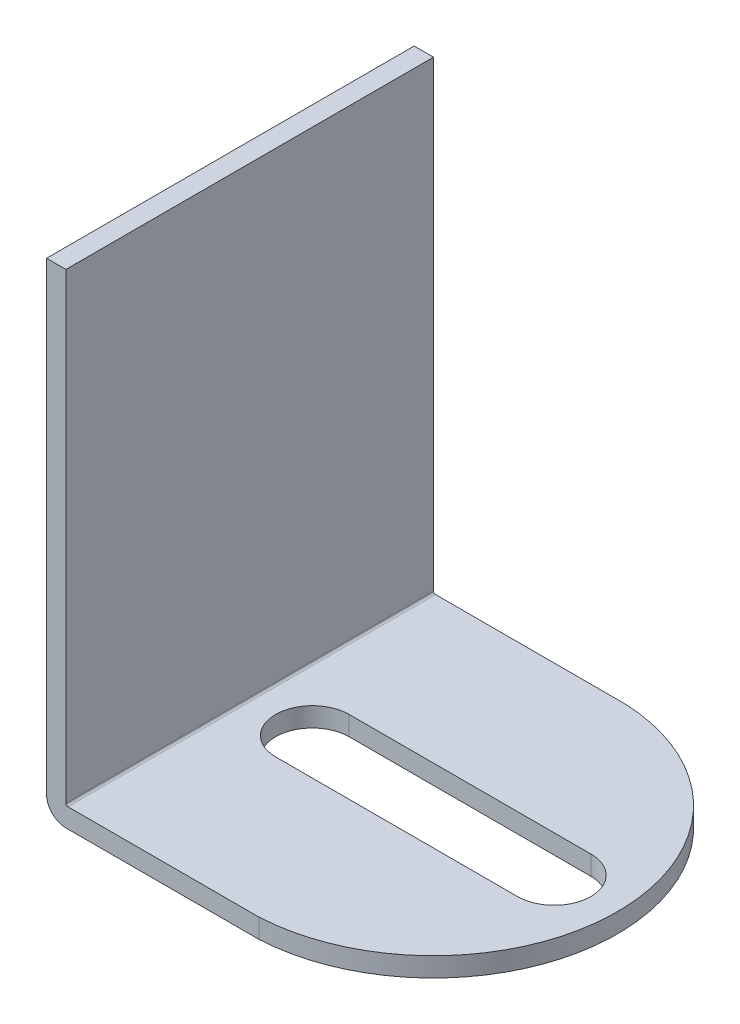
ISO-10303-21;
HEADER;
FILE_DESCRIPTION(('STEP AP214'),'2;1');
FILE_NAME('part.step','',(''),(''),'','','');
FILE_SCHEMA(('AUTOMOTIVE_DESIGN { 1 0 10303 214 1 1 1 1 }'));
ENDSEC;
DATA;
#1=APPLICATION_CONTEXT('core data for automotive mechanical design processes');
#2=APPLICATION_PROTOCOL_DEFINITION('international standard','automotive_design',2000,#1);
#3=PRODUCT_CONTEXT('',#1,'mechanical');
#4=PRODUCT('Part','Part','',(#3));
#5=PRODUCT_RELATED_PRODUCT_CATEGORY('part','',(#4));
#6=PRODUCT_DEFINITION_FORMATION('','',#4);
#7=PRODUCT_DEFINITION_CONTEXT('part definition',#1,'design');
#8=PRODUCT_DEFINITION('design','',#6,#7);
#9=PRODUCT_DEFINITION_SHAPE('','',#8);
#10=(LENGTH_UNIT() NAMED_UNIT(*) SI_UNIT(.MILLI.,.METRE.));
#11=(NAMED_UNIT(*) PLANE_ANGLE_UNIT() SI_UNIT($,.RADIAN.));
#12=(NAMED_UNIT(*) SI_UNIT($,.STERADIAN.) SOLID_ANGLE_UNIT());
#13=UNCERTAINTY_MEASURE_WITH_UNIT(LENGTH_MEASURE(1.E-05),#10,'distance_accuracy_value','');
#14=(GEOMETRIC_REPRESENTATION_CONTEXT(3) GLOBAL_UNCERTAINTY_ASSIGNED_CONTEXT((#13)) GLOBAL_UNIT_ASSIGNED_CONTEXT((#10,
#11,#12)) REPRESENTATION_CONTEXT('',''));
#15=CARTESIAN_POINT('',(0.,0.,0.));
#16=DIRECTION('',(0.,0.,1.));
#17=DIRECTION('',(1.,0.,0.));
#18=AXIS2_PLACEMENT_3D('',#15,#16,#17);
#19=CARTESIAN_POINT('',(0.,-25.,38.));
#20=DIRECTION('',(0.,1.,0.));
#21=DIRECTION('',(0.,0.,1.));
#22=AXIS2_PLACEMENT_3D('',#19,#20,#21);
#23=PLANE('',#22);
#24=DIRECTION('',(1.,0.,0.));
#25=VECTOR('',#24,1.);
#26=CARTESIAN_POINT('',(0.,-25.,0.));
#27=LINE('',#26,#25);
#28=CARTESIAN_POINT('',(-18.0000001862645,-25.,0.));
#29=VERTEX_POINT('',#28);
#30=CARTESIAN_POINT('',(1.95000035436831,-25.,0.));
#31=VERTEX_POINT('',#30);
#32=EDGE_CURVE('E243',#29,#31,#27,.T.);
#33=ORIENTED_EDGE('',*,*,#32,.T.);
#34=CARTESIAN_POINT('',(0.975000177184177,-25.,19.));
#35=DIRECTION('',(0.,-1.,0.));
#36=DIRECTION('',(0.,0.,-1.));
#37=AXIS2_PLACEMENT_3D('',#34,#35,#36);
#38=CIRCLE('',#37,19.0250000090804);
#39=CARTESIAN_POINT('',(1.95000035436831,-25.,38.));
#40=VERTEX_POINT('',#39);
#41=EDGE_CURVE('E208',#40,#31,#38,.F.);
#42=ORIENTED_EDGE('',*,*,#41,.F.);
#43=DIRECTION('',(1.,0.,0.));
#44=VECTOR('',#43,1.);
#45=CARTESIAN_POINT('',(0.,-25.,38.));
#46=LINE('',#45,#44);
#47=CARTESIAN_POINT('',(-18.0000001862645,-25.,38.));
#48=VERTEX_POINT('',#47);
#49=EDGE_CURVE('E227',#48,#40,#46,.T.);
#50=ORIENTED_EDGE('',*,*,#49,.F.);
#51=DIRECTION('',(0.,0.,-1.));
#52=VECTOR('',#51,1.);
#53=CARTESIAN_POINT('',(-18.0000001862645,-25.,38.));
#54=LINE('',#53,#52);
#55=EDGE_CURVE('E249',#48,#29,#54,.T.);
#56=ORIENTED_EDGE('',*,*,#55,.T.);
#57=EDGE_LOOP('',(#33,#42,#50,#56));
#58=FACE_BOUND('',#57,.T.);
#59=CARTESIAN_POINT('',(13.4706343605666,-25.,19.));
#60=DIRECTION('',(0.,-1.,0.));
#61=DIRECTION('',(0.,0.,-1.));
#62=AXIS2_PLACEMENT_3D('',#59,#60,#61);
#63=CIRCLE('',#62,3.80060414960901);
#64=CARTESIAN_POINT('',(13.4706343605666,-25.,15.199395850391));
#65=VERTEX_POINT('',#64);
#66=CARTESIAN_POINT('',(13.4706343605666,-25.,22.800604149609));
#67=VERTEX_POINT('',#66);
#68=EDGE_CURVE('E196',#65,#67,#63,.T.);
#69=ORIENTED_EDGE('',*,*,#68,.F.);
#70=DIRECTION('',(1.,0.,0.));
#71=VECTOR('',#70,1.);
#72=CARTESIAN_POINT('',(0.,-25.,15.199395850391));
#73=LINE('',#72,#71);
#74=CARTESIAN_POINT('',(-11.5206340061982,-25.,15.199395850391));
#75=VERTEX_POINT('',#74);
#76=EDGE_CURVE('E110',#75,#65,#73,.T.);
#77=ORIENTED_EDGE('',*,*,#76,.F.);
#78=CARTESIAN_POINT('',(-11.5206340061982,-25.,19.));
#79=DIRECTION('',(0.,-1.,0.));
#80=DIRECTION('',(0.,0.,-1.));
#81=AXIS2_PLACEMENT_3D('',#78,#79,#80);
#82=CIRCLE('',#81,3.80060414960901);
#83=CARTESIAN_POINT('',(-11.5206340061982,-25.,22.800604149609));
#84=VERTEX_POINT('',#83);
#85=EDGE_CURVE('E201',#84,#75,#82,.T.);
#86=ORIENTED_EDGE('',*,*,#85,.F.);
#87=DIRECTION('',(1.,0.,0.));
#88=VECTOR('',#87,1.);
#89=CARTESIAN_POINT('',(0.,-25.,22.800604149609));
#90=LINE('',#89,#88);
#91=EDGE_CURVE('E187',#84,#67,#90,.T.);
#92=ORIENTED_EDGE('',*,*,#91,.T.);
#93=EDGE_LOOP('',(#69,#77,#86,#92));
#94=FACE_BOUND('',#93,.T.);
#95=ADVANCED_FACE('F95',(#58,#94),#23,.F.);
#96=CARTESIAN_POINT('',(0.,-23.,38.));
#97=DIRECTION('',(0.,-1.,0.));
#98=DIRECTION('',(0.,0.,-1.));
#99=AXIS2_PLACEMENT_3D('',#96,#97,#98);
#100=PLANE('',#99);
#101=CARTESIAN_POINT('',(0.975000177184177,-23.,19.));
#102=DIRECTION('',(0.,-1.,0.));
#103=DIRECTION('',(0.,0.,-1.));
#104=AXIS2_PLACEMENT_3D('',#101,#102,#103);
#105=CIRCLE('',#104,19.0250000090804);
#106=CARTESIAN_POINT('',(1.95000035436831,-23.,38.));
#107=VERTEX_POINT('',#106);
#108=CARTESIAN_POINT('',(1.95000035436831,-23.,0.));
#109=VERTEX_POINT('',#108);
#110=EDGE_CURVE('E212',#107,#109,#105,.F.);
#111=ORIENTED_EDGE('',*,*,#110,.T.);
#112=DIRECTION('',(-1.,0.,0.));
#113=VECTOR('',#112,1.);
#114=CARTESIAN_POINT('',(0.,-23.,0.));
#115=LINE('',#114,#113);
#116=CARTESIAN_POINT('',(-17.8000001862645,-23.,0.));
#117=VERTEX_POINT('',#116);
#118=EDGE_CURVE('E219',#109,#117,#115,.T.);
#119=ORIENTED_EDGE('',*,*,#118,.T.);
#120=DIRECTION('',(0.,0.,-1.));
#121=VECTOR('',#120,1.);
#122=CARTESIAN_POINT('',(-17.8000001862645,-23.,38.));
#123=LINE('',#122,#121);
#124=CARTESIAN_POINT('',(-17.8000001862645,-23.,38.));
#125=VERTEX_POINT('',#124);
#126=EDGE_CURVE('E232',#125,#117,#123,.T.);
#127=ORIENTED_EDGE('',*,*,#126,.F.);
#128=DIRECTION('',(-1.,0.,0.));
#129=VECTOR('',#128,1.);
#130=CARTESIAN_POINT('',(0.,-23.,38.));
#131=LINE('',#130,#129);
#132=EDGE_CURVE('E230',#107,#125,#131,.T.);
#133=ORIENTED_EDGE('',*,*,#132,.F.);
#134=EDGE_LOOP('',(#111,#119,#127,#133));
#135=FACE_BOUND('',#134,.T.);
#136=CARTESIAN_POINT('',(-11.5206340061982,-23.,19.));
#137=DIRECTION('',(0.,-1.,0.));
#138=DIRECTION('',(0.,0.,-1.));
#139=AXIS2_PLACEMENT_3D('',#136,#137,#138);
#140=CIRCLE('',#139,3.80060414960901);
#141=CARTESIAN_POINT('',(-11.5206340061982,-23.,22.800604149609));
#142=VERTEX_POINT('',#141);
#143=CARTESIAN_POINT('',(-11.5206340061982,-23.,15.199395850391));
#144=VERTEX_POINT('',#143);
#145=EDGE_CURVE('E103',#142,#144,#140,.T.);
#146=ORIENTED_EDGE('',*,*,#145,.T.);
#147=DIRECTION('',(1.,0.,0.));
#148=VECTOR('',#147,1.);
#149=CARTESIAN_POINT('',(0.,-23.,15.199395850391));
#150=LINE('',#149,#148);
#151=CARTESIAN_POINT('',(13.4706343605666,-23.,15.199395850391));
#152=VERTEX_POINT('',#151);
#153=EDGE_CURVE('E12',#144,#152,#150,.T.);
#154=ORIENTED_EDGE('',*,*,#153,.T.);
#155=CARTESIAN_POINT('',(13.4706343605666,-23.,19.));
#156=DIRECTION('',(0.,-1.,0.));
#157=DIRECTION('',(0.,0.,-1.));
#158=AXIS2_PLACEMENT_3D('',#155,#156,#157);
#159=CIRCLE('',#158,3.80060414960901);
#160=CARTESIAN_POINT('',(13.4706343605666,-23.,22.800604149609));
#161=VERTEX_POINT('',#160);
#162=EDGE_CURVE('E268',#152,#161,#159,.T.);
#163=ORIENTED_EDGE('',*,*,#162,.T.);
#164=DIRECTION('',(1.,0.,0.));
#165=VECTOR('',#164,1.);
#166=CARTESIAN_POINT('',(0.,-23.,22.800604149609));
#167=LINE('',#166,#165);
#168=EDGE_CURVE('E190',#142,#161,#167,.T.);
#169=ORIENTED_EDGE('',*,*,#168,.F.);
#170=EDGE_LOOP('',(#146,#154,#163,#169));
#171=FACE_BOUND('',#170,.T.);
#172=ADVANCED_FACE('F272',(#135,#171),#100,.F.);
#173=CARTESIAN_POINT('',(-17.8000001862645,-22.8,38.));
#174=DIRECTION('',(0.,0.,-1.));
#175=DIRECTION('',(-1.,0.,0.));
#176=AXIS2_PLACEMENT_3D('',#173,#174,#175);
#177=CYLINDRICAL_SURFACE('',#176,0.199999999999988);
#178=CARTESIAN_POINT('',(-17.8000001862645,-22.8,0.));
#179=DIRECTION('',(0.,0.,1.));
#180=DIRECTION('',(1.,0.,0.));
#181=AXIS2_PLACEMENT_3D('',#178,#179,#180);
#182=CIRCLE('',#181,0.199999999999988);
#183=CARTESIAN_POINT('',(-18.0000001862645,-22.8,0.));
#184=VERTEX_POINT('',#183);
#185=EDGE_CURVE('E214',#184,#117,#182,.T.);
#186=ORIENTED_EDGE('',*,*,#185,.F.);
#187=DIRECTION('',(0.,0.,-1.));
#188=VECTOR('',#187,1.);
#189=CARTESIAN_POINT('',(-18.0000001862645,-22.8,38.));
#190=LINE('',#189,#188);
#191=CARTESIAN_POINT('',(-18.0000001862645,-22.8,38.));
#192=VERTEX_POINT('',#191);
#193=EDGE_CURVE('E261',#192,#184,#190,.T.);
#194=ORIENTED_EDGE('',*,*,#193,.F.);
#195=CARTESIAN_POINT('',(-17.8000001862645,-22.8,38.));
#196=DIRECTION('',(0.,0.,1.));
#197=DIRECTION('',(1.,0.,0.));
#198=AXIS2_PLACEMENT_3D('',#195,#196,#197);
#199=CIRCLE('',#198,0.199999999999988);
#200=EDGE_CURVE('E215',#192,#125,#199,.T.);
#201=ORIENTED_EDGE('',*,*,#200,.T.);
#202=ORIENTED_EDGE('',*,*,#126,.T.);
#203=EDGE_LOOP('',(#186,#194,#201,#202));
#204=FACE_BOUND('',#203,.T.);
#205=ADVANCED_FACE('F97',(#204),#177,.F.);
#206=CARTESIAN_POINT('',(-18.0000001862645,0.,38.));
#207=DIRECTION('',(-1.,0.,0.));
#208=DIRECTION('',(0.,0.,1.));
#209=AXIS2_PLACEMENT_3D('',#206,#207,#208);
#210=PLANE('',#209);
#211=DIRECTION('',(0.,1.,0.));
#212=VECTOR('',#211,1.);
#213=CARTESIAN_POINT('',(-18.0000001862645,0.,0.));
#214=LINE('',#213,#212);
#215=CARTESIAN_POINT('',(-18.0000001862645,25.,0.));
#216=VERTEX_POINT('',#215);
#217=EDGE_CURVE('E235',#184,#216,#214,.T.);
#218=ORIENTED_EDGE('',*,*,#217,.T.);
#219=DIRECTION('',(0.,0.,-1.));
#220=VECTOR('',#219,1.);
#221=CARTESIAN_POINT('',(-18.0000001862645,25.,38.));
#222=LINE('',#221,#220);
#223=CARTESIAN_POINT('',(-18.0000001862645,25.,38.));
#224=VERTEX_POINT('',#223);
#225=EDGE_CURVE('E258',#224,#216,#222,.T.);
#226=ORIENTED_EDGE('',*,*,#225,.F.);
#227=DIRECTION('',(0.,1.,0.));
#228=VECTOR('',#227,1.);
#229=CARTESIAN_POINT('',(-18.0000001862645,0.,38.));
#230=LINE('',#229,#228);
#231=EDGE_CURVE('E218',#192,#224,#230,.T.);
#232=ORIENTED_EDGE('',*,*,#231,.F.);
#233=ORIENTED_EDGE('',*,*,#193,.T.);
#234=EDGE_LOOP('',(#218,#226,#232,#233));
#235=FACE_BOUND('',#234,.T.);
#236=ADVANCED_FACE('F310',(#235),#210,.F.);
#237=CARTESIAN_POINT('',(0.,25.,38.));
#238=DIRECTION('',(0.,-1.,0.));
#239=DIRECTION('',(0.,0.,-1.));
#240=AXIS2_PLACEMENT_3D('',#237,#238,#239);
#241=PLANE('',#240);
#242=DIRECTION('',(-1.,0.,0.));
#243=VECTOR('',#242,1.);
#244=CARTESIAN_POINT('',(0.,25.,0.));
#245=LINE('',#244,#243);
#246=CARTESIAN_POINT('',(-20.0000001862645,25.,0.));
#247=VERTEX_POINT('',#246);
#248=EDGE_CURVE('E237',#216,#247,#245,.T.);
#249=ORIENTED_EDGE('',*,*,#248,.T.);
#250=DIRECTION('',(0.,0.,-1.));
#251=VECTOR('',#250,1.);
#252=CARTESIAN_POINT('',(-20.0000001862645,25.,38.));
#253=LINE('',#252,#251);
#254=CARTESIAN_POINT('',(-20.0000001862645,25.,38.));
#255=VERTEX_POINT('',#254);
#256=EDGE_CURVE('E255',#255,#247,#253,.T.);
#257=ORIENTED_EDGE('',*,*,#256,.F.);
#258=DIRECTION('',(-1.,0.,0.));
#259=VECTOR('',#258,1.);
#260=CARTESIAN_POINT('',(0.,25.,38.));
#261=LINE('',#260,#259);
#262=EDGE_CURVE('E221',#224,#255,#261,.T.);
#263=ORIENTED_EDGE('',*,*,#262,.F.);
#264=ORIENTED_EDGE('',*,*,#225,.T.);
#265=EDGE_LOOP('',(#249,#257,#263,#264));
#266=FACE_BOUND('',#265,.T.);
#267=ADVANCED_FACE('F307',(#266),#241,.F.);
#268=CARTESIAN_POINT('',(-20.0000001862645,0.,38.));
#269=DIRECTION('',(1.,0.,0.));
#270=DIRECTION('',(0.,0.,-1.));
#271=AXIS2_PLACEMENT_3D('',#268,#269,#270);
#272=PLANE('',#271);
#273=DIRECTION('',(0.,-1.,0.));
#274=VECTOR('',#273,1.);
#275=CARTESIAN_POINT('',(-20.0000001862645,0.,0.));
#276=LINE('',#275,#274);
#277=CARTESIAN_POINT('',(-20.0000001862645,-23.,0.));
#278=VERTEX_POINT('',#277);
#279=EDGE_CURVE('E239',#247,#278,#276,.T.);
#280=ORIENTED_EDGE('',*,*,#279,.T.);
#281=DIRECTION('',(0.,0.,-1.));
#282=VECTOR('',#281,1.);
#283=CARTESIAN_POINT('',(-20.0000001862645,-23.,38.));
#284=LINE('',#283,#282);
#285=CARTESIAN_POINT('',(-20.0000001862645,-23.,38.));
#286=VERTEX_POINT('',#285);
#287=EDGE_CURVE('E252',#286,#278,#284,.T.);
#288=ORIENTED_EDGE('',*,*,#287,.F.);
#289=DIRECTION('',(0.,-1.,0.));
#290=VECTOR('',#289,1.);
#291=CARTESIAN_POINT('',(-20.0000001862645,0.,38.));
#292=LINE('',#291,#290);
#293=EDGE_CURVE('E223',#255,#286,#292,.T.);
#294=ORIENTED_EDGE('',*,*,#293,.F.);
#295=ORIENTED_EDGE('',*,*,#256,.T.);
#296=EDGE_LOOP('',(#280,#288,#294,#295));
#297=FACE_BOUND('',#296,.T.);
#298=ADVANCED_FACE('F303',(#297),#272,.F.);
#299=CARTESIAN_POINT('',(-18.0000001862645,-23.,38.));
#300=DIRECTION('',(0.,0.,-1.));
#301=DIRECTION('',(-1.,0.,0.));
#302=AXIS2_PLACEMENT_3D('',#299,#300,#301);
#303=CYLINDRICAL_SURFACE('',#302,2.);
#304=CARTESIAN_POINT('',(-18.0000001862645,-23.,0.));
#305=DIRECTION('',(0.,0.,1.));
#306=DIRECTION('',(1.,0.,0.));
#307=AXIS2_PLACEMENT_3D('',#304,#305,#306);
#308=CIRCLE('',#307,2.);
#309=EDGE_CURVE('E241',#278,#29,#308,.T.);
#310=ORIENTED_EDGE('',*,*,#309,.T.);
#311=ORIENTED_EDGE('',*,*,#55,.F.);
#312=CARTESIAN_POINT('',(-18.0000001862645,-23.,38.));
#313=DIRECTION('',(0.,0.,1.));
#314=DIRECTION('',(1.,0.,0.));
#315=AXIS2_PLACEMENT_3D('',#312,#313,#314);
#316=CIRCLE('',#315,2.);
#317=EDGE_CURVE('E225',#286,#48,#316,.T.);
#318=ORIENTED_EDGE('',*,*,#317,.F.);
#319=ORIENTED_EDGE('',*,*,#287,.T.);
#320=EDGE_LOOP('',(#310,#311,#318,#319));
#321=FACE_BOUND('',#320,.T.);
#322=ADVANCED_FACE('F299',(#321),#303,.T.);
#323=CARTESIAN_POINT('',(0.,0.,38.));
#324=DIRECTION('',(0.,0.,1.));
#325=DIRECTION('',(1.,0.,0.));
#326=AXIS2_PLACEMENT_3D('',#323,#324,#325);
#327=PLANE('',#326);
#328=DIRECTION('',(0.,-1.,0.));
#329=VECTOR('',#328,1.);
#330=CARTESIAN_POINT('',(1.95000035436831,13.,38.));
#331=LINE('',#330,#329);
#332=EDGE_CURVE('E263',#107,#40,#331,.T.);
#333=ORIENTED_EDGE('',*,*,#332,.F.);
#334=ORIENTED_EDGE('',*,*,#132,.T.);
#335=ORIENTED_EDGE('',*,*,#200,.F.);
#336=ORIENTED_EDGE('',*,*,#231,.T.);
#337=ORIENTED_EDGE('',*,*,#262,.T.);
#338=ORIENTED_EDGE('',*,*,#293,.T.);
#339=ORIENTED_EDGE('',*,*,#317,.T.);
#340=ORIENTED_EDGE('',*,*,#49,.T.);
#341=EDGE_LOOP('',(#333,#334,#335,#336,#337,#338,#339,#340));
#342=FACE_BOUND('',#341,.T.);
#343=ADVANCED_FACE('F302',(#342),#327,.T.);
#344=CARTESIAN_POINT('',(0.,0.,0.));
#345=DIRECTION('',(0.,0.,1.));
#346=DIRECTION('',(1.,0.,0.));
#347=AXIS2_PLACEMENT_3D('',#344,#345,#346);
#348=PLANE('',#347);
#349=ORIENTED_EDGE('',*,*,#118,.F.);
#350=DIRECTION('',(0.,-1.,0.));
#351=VECTOR('',#350,1.);
#352=CARTESIAN_POINT('',(1.95000035436831,13.,0.));
#353=LINE('',#352,#351);
#354=EDGE_CURVE('E265',#109,#31,#353,.T.);
#355=ORIENTED_EDGE('',*,*,#354,.T.);
#356=ORIENTED_EDGE('',*,*,#32,.F.);
#357=ORIENTED_EDGE('',*,*,#309,.F.);
#358=ORIENTED_EDGE('',*,*,#279,.F.);
#359=ORIENTED_EDGE('',*,*,#248,.F.);
#360=ORIENTED_EDGE('',*,*,#217,.F.);
#361=ORIENTED_EDGE('',*,*,#185,.T.);
#362=EDGE_LOOP('',(#349,#355,#356,#357,#358,#359,#360,#361));
#363=FACE_BOUND('',#362,.T.);
#364=ADVANCED_FACE('F285',(#363),#348,.F.);
#365=CARTESIAN_POINT('',(0.975000177184177,13.,19.));
#366=DIRECTION('',(0.,-1.,0.));
#367=DIRECTION('',(0.,0.,-1.));
#368=AXIS2_PLACEMENT_3D('',#365,#366,#367);
#369=CYLINDRICAL_SURFACE('',#368,19.0250000090804);
#370=ORIENTED_EDGE('',*,*,#332,.T.);
#371=ORIENTED_EDGE('',*,*,#41,.T.);
#372=ORIENTED_EDGE('',*,*,#354,.F.);
#373=ORIENTED_EDGE('',*,*,#110,.F.);
#374=EDGE_LOOP('',(#370,#371,#372,#373));
#375=FACE_BOUND('',#374,.T.);
#376=ADVANCED_FACE('F278',(#375),#369,.T.);
#377=CARTESIAN_POINT('',(0.,13.,15.199395850391));
#378=DIRECTION('',(0.,0.,-1.));
#379=DIRECTION('',(-1.,0.,0.));
#380=AXIS2_PLACEMENT_3D('',#377,#378,#379);
#381=PLANE('',#380);
#382=DIRECTION('',(0.,-1.,0.));
#383=VECTOR('',#382,1.);
#384=CARTESIAN_POINT('',(-11.5206340061982,13.,15.199395850391));
#385=LINE('',#384,#383);
#386=EDGE_CURVE('E206',#144,#75,#385,.T.);
#387=ORIENTED_EDGE('',*,*,#386,.T.);
#388=ORIENTED_EDGE('',*,*,#76,.T.);
#389=DIRECTION('',(0.,-1.,0.));
#390=VECTOR('',#389,1.);
#391=CARTESIAN_POINT('',(13.4706343605666,13.,15.199395850391));
#392=LINE('',#391,#390);
#393=EDGE_CURVE('E193',#152,#65,#392,.T.);
#394=ORIENTED_EDGE('',*,*,#393,.F.);
#395=ORIENTED_EDGE('',*,*,#153,.F.);
#396=EDGE_LOOP('',(#387,#388,#394,#395));
#397=FACE_BOUND('',#396,.T.);
#398=ADVANCED_FACE('F276',(#397),#381,.F.);
#399=CARTESIAN_POINT('',(-11.5206340061982,13.,19.));
#400=DIRECTION('',(0.,-1.,0.));
#401=DIRECTION('',(0.,0.,-1.));
#402=AXIS2_PLACEMENT_3D('',#399,#400,#401);
#403=CYLINDRICAL_SURFACE('',#402,3.80060414960901);
#404=DIRECTION('',(0.,-1.,0.));
#405=VECTOR('',#404,1.);
#406=CARTESIAN_POINT('',(-11.5206340061982,13.,22.800604149609));
#407=LINE('',#406,#405);
#408=EDGE_CURVE('E192',#142,#84,#407,.T.);
#409=ORIENTED_EDGE('',*,*,#408,.T.);
#410=ORIENTED_EDGE('',*,*,#85,.T.);
#411=ORIENTED_EDGE('',*,*,#386,.F.);
#412=ORIENTED_EDGE('',*,*,#145,.F.);
#413=EDGE_LOOP('',(#409,#410,#411,#412));
#414=FACE_BOUND('',#413,.T.);
#415=ADVANCED_FACE('F275',(#414),#403,.F.);
#416=CARTESIAN_POINT('',(0.,13.,22.800604149609));
#417=DIRECTION('',(0.,0.,-1.));
#418=DIRECTION('',(-1.,0.,0.));
#419=AXIS2_PLACEMENT_3D('',#416,#417,#418);
#420=PLANE('',#419);
#421=ORIENTED_EDGE('',*,*,#168,.T.);
#422=DIRECTION('',(0.,-1.,0.));
#423=VECTOR('',#422,1.);
#424=CARTESIAN_POINT('',(13.4706343605666,13.,22.800604149609));
#425=LINE('',#424,#423);
#426=EDGE_CURVE('E118',#161,#67,#425,.T.);
#427=ORIENTED_EDGE('',*,*,#426,.T.);
#428=ORIENTED_EDGE('',*,*,#91,.F.);
#429=ORIENTED_EDGE('',*,*,#408,.F.);
#430=EDGE_LOOP('',(#421,#427,#428,#429));
#431=FACE_BOUND('',#430,.T.);
#432=ADVANCED_FACE('F184',(#431),#420,.T.);
#433=CARTESIAN_POINT('',(13.4706343605666,13.,19.));
#434=DIRECTION('',(0.,-1.,0.));
#435=DIRECTION('',(0.,0.,-1.));
#436=AXIS2_PLACEMENT_3D('',#433,#434,#435);
#437=CYLINDRICAL_SURFACE('',#436,3.80060414960901);
#438=ORIENTED_EDGE('',*,*,#393,.T.);
#439=ORIENTED_EDGE('',*,*,#68,.T.);
#440=ORIENTED_EDGE('',*,*,#426,.F.);
#441=ORIENTED_EDGE('',*,*,#162,.F.);
#442=EDGE_LOOP('',(#438,#439,#440,#441));
#443=FACE_BOUND('',#442,.T.);
#444=ADVANCED_FACE('F197',(#443),#437,.F.);
#445=CLOSED_SHELL('',(#95,#172,#205,#236,#267,#298,#322,#343,#364,#376,#398,#415,#432,#444));
#446=MANIFOLD_SOLID_BREP('B2',#445);
#447=ADVANCED_BREP_SHAPE_REPRESENTATION('',(#18,#446),#14);
#448=SHAPE_DEFINITION_REPRESENTATION(#9,#447);
ENDSEC;
END-ISO-10303-21;
